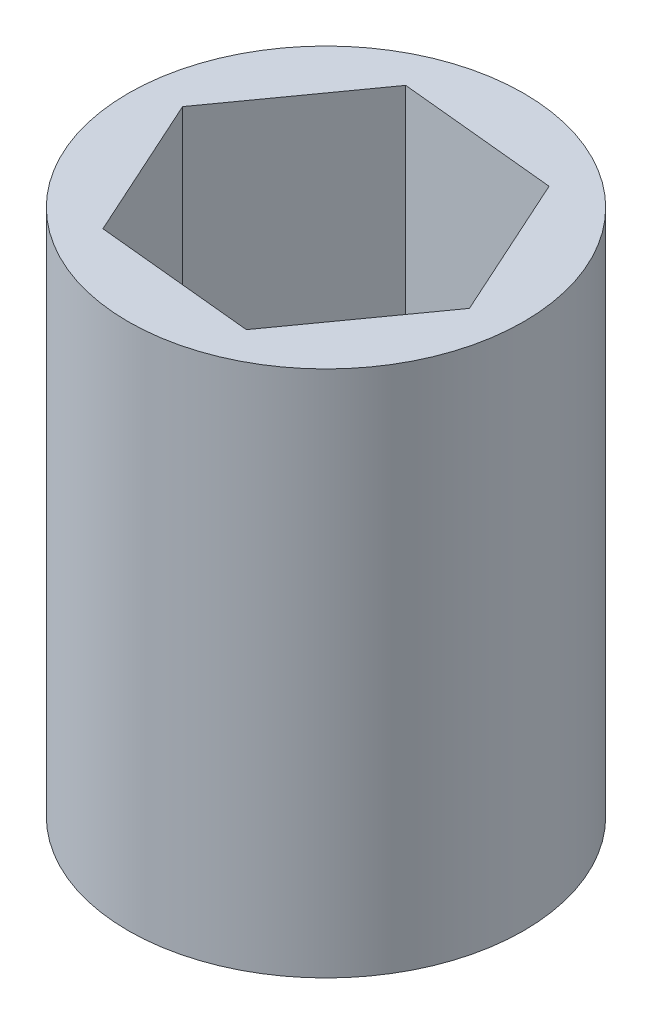
ISO-10303-21;
HEADER;
FILE_DESCRIPTION(('STEP AP214'),'2;1');
FILE_NAME('part.step','',(''),(''),'','','');
FILE_SCHEMA(('AUTOMOTIVE_DESIGN { 1 0 10303 214 1 1 1 1 }'));
ENDSEC;
DATA;
#1=APPLICATION_CONTEXT('core data for automotive mechanical design processes');
#2=APPLICATION_PROTOCOL_DEFINITION('international standard','automotive_design',2000,#1);
#3=PRODUCT_CONTEXT('',#1,'mechanical');
#4=PRODUCT('Part','Part','',(#3));
#5=PRODUCT_RELATED_PRODUCT_CATEGORY('part','',(#4));
#6=PRODUCT_DEFINITION_FORMATION('','',#4);
#7=PRODUCT_DEFINITION_CONTEXT('part definition',#1,'design');
#8=PRODUCT_DEFINITION('design','',#6,#7);
#9=PRODUCT_DEFINITION_SHAPE('','',#8);
#10=(LENGTH_UNIT() NAMED_UNIT(*) SI_UNIT(.MILLI.,.METRE.));
#11=(NAMED_UNIT(*) PLANE_ANGLE_UNIT() SI_UNIT($,.RADIAN.));
#12=(NAMED_UNIT(*) SI_UNIT($,.STERADIAN.) SOLID_ANGLE_UNIT());
#13=UNCERTAINTY_MEASURE_WITH_UNIT(LENGTH_MEASURE(1.E-05),#10,'distance_accuracy_value','');
#14=(GEOMETRIC_REPRESENTATION_CONTEXT(3) GLOBAL_UNCERTAINTY_ASSIGNED_CONTEXT((#13)) GLOBAL_UNIT_ASSIGNED_CONTEXT((#10,
#11,#12)) REPRESENTATION_CONTEXT('',''));
#15=CARTESIAN_POINT('',(0.,0.,0.));
#16=DIRECTION('',(0.,0.,1.));
#17=DIRECTION('',(1.,0.,0.));
#18=AXIS2_PLACEMENT_3D('',#15,#16,#17);
#19=CARTESIAN_POINT('',(0.,50.8,0.));
#20=DIRECTION('',(0.,-1.,0.));
#21=DIRECTION('',(0.,0.,-1.));
#22=AXIS2_PLACEMENT_3D('',#19,#20,#21);
#23=CYLINDRICAL_SURFACE('',#22,19.05);
#24=CARTESIAN_POINT('',(0.,50.8,0.));
#25=DIRECTION('',(0.,1.,0.));
#26=DIRECTION('',(0.,0.,1.));
#27=AXIS2_PLACEMENT_3D('',#24,#25,#26);
#28=CIRCLE('',#27,19.05);
#29=CARTESIAN_POINT('',(0.,50.8,19.05));
#30=VERTEX_POINT('',#29);
#31=EDGE_CURVE('E11',#30,#30,#28,.T.);
#32=ORIENTED_EDGE('',*,*,#31,.F.);
#33=EDGE_LOOP('',(#32));
#34=FACE_BOUND('',#33,.T.);
#35=CARTESIAN_POINT('',(0.,0.,0.));
#36=DIRECTION('',(0.,1.,0.));
#37=DIRECTION('',(0.,0.,1.));
#38=AXIS2_PLACEMENT_3D('',#35,#36,#37);
#39=CIRCLE('',#38,19.05);
#40=CARTESIAN_POINT('',(0.,0.,19.05));
#41=VERTEX_POINT('',#40);
#42=EDGE_CURVE('E42',#41,#41,#39,.T.);
#43=ORIENTED_EDGE('',*,*,#42,.T.);
#44=EDGE_LOOP('',(#43));
#45=FACE_BOUND('',#44,.T.);
#46=ADVANCED_FACE('F39',(#34,#45),#23,.T.);
#47=CARTESIAN_POINT('',(0.,50.8,0.));
#48=DIRECTION('',(0.,1.,0.));
#49=DIRECTION('',(0.,0.,1.));
#50=AXIS2_PLACEMENT_3D('',#47,#48,#49);
#51=PLANE('',#50);
#52=DIRECTION('',(0.582558314438273,0.,-0.812788908806486));
#53=VECTOR('',#52,1.);
#54=CARTESIAN_POINT('',(-15.3236366613952,50.8,-1.510781079292));
#55=LINE('',#54,#53);
#56=CARTESIAN_POINT('',(-15.3236366613952,50.8,-1.510781079292));
#57=VERTEX_POINT('',#56);
#58=CARTESIAN_POINT('',(-6.35344353647385,50.8,-14.0260491667768));
#59=VERTEX_POINT('',#58);
#60=EDGE_CURVE('E107',#57,#59,#55,.T.);
#61=ORIENTED_EDGE('',*,*,#60,.T.);
#62=DIRECTION('',(0.995175000159787,0.,0.0981158450861447));
#63=VECTOR('',#62,1.);
#64=CARTESIAN_POINT('',(-6.35344353647385,50.8,-14.0260491667768));
#65=LINE('',#64,#63);
#66=CARTESIAN_POINT('',(8.97019312492135,50.8,-12.5152680874848));
#67=VERTEX_POINT('',#66);
#68=EDGE_CURVE('E93',#59,#67,#65,.T.);
#69=ORIENTED_EDGE('',*,*,#68,.T.);
#70=DIRECTION('',(0.412616685721513,0.,0.910904753892631));
#71=VECTOR('',#70,1.);
#72=CARTESIAN_POINT('',(8.97019312492135,50.8,-12.5152680874848));
#73=LINE('',#72,#71);
#74=CARTESIAN_POINT('',(15.3236366613952,50.8,1.510781079292));
#75=VERTEX_POINT('',#74);
#76=EDGE_CURVE('E139',#67,#75,#73,.T.);
#77=ORIENTED_EDGE('',*,*,#76,.T.);
#78=DIRECTION('',(-0.582558314438273,0.,0.812788908806486));
#79=VECTOR('',#78,1.);
#80=CARTESIAN_POINT('',(15.3236366613952,50.8,1.510781079292));
#81=LINE('',#80,#79);
#82=CARTESIAN_POINT('',(6.35344353647386,50.8,14.0260491667768));
#83=VERTEX_POINT('',#82);
#84=EDGE_CURVE('E134',#75,#83,#81,.T.);
#85=ORIENTED_EDGE('',*,*,#84,.T.);
#86=DIRECTION('',(-0.995175000159787,0.,-0.0981158450861446));
#87=VECTOR('',#86,1.);
#88=CARTESIAN_POINT('',(6.35344353647386,50.8,14.0260491667768));
#89=LINE('',#88,#87);
#90=CARTESIAN_POINT('',(-8.97019312492135,50.8,12.5152680874848));
#91=VERTEX_POINT('',#90);
#92=EDGE_CURVE('E130',#83,#91,#89,.T.);
#93=ORIENTED_EDGE('',*,*,#92,.T.);
#94=DIRECTION('',(-0.412616685721514,0.,-0.91090475389263));
#95=VECTOR('',#94,1.);
#96=CARTESIAN_POINT('',(-8.97019312492135,50.8,12.5152680874848));
#97=LINE('',#96,#95);
#98=EDGE_CURVE('E117',#91,#57,#97,.T.);
#99=ORIENTED_EDGE('',*,*,#98,.T.);
#100=EDGE_LOOP('',(#61,#69,#77,#85,#93,#99));
#101=FACE_BOUND('',#100,.T.);
#102=ORIENTED_EDGE('',*,*,#31,.T.);
#103=EDGE_LOOP('',(#102));
#104=FACE_BOUND('',#103,.T.);
#105=ADVANCED_FACE('F114',(#101,#104),#51,.T.);
#106=CARTESIAN_POINT('',(0.,0.,0.));
#107=DIRECTION('',(0.,1.,0.));
#108=DIRECTION('',(0.,0.,1.));
#109=AXIS2_PLACEMENT_3D('',#106,#107,#108);
#110=PLANE('',#109);
#111=DIRECTION('',(0.995175000159787,0.,0.0981158450861447));
#112=VECTOR('',#111,1.);
#113=CARTESIAN_POINT('',(-6.35344353647385,0.,-14.0260491667768));
#114=LINE('',#113,#112);
#115=CARTESIAN_POINT('',(-6.35344353647385,0.,-14.0260491667768));
#116=VERTEX_POINT('',#115);
#117=CARTESIAN_POINT('',(8.97019312492135,0.,-12.5152680874848));
#118=VERTEX_POINT('',#117);
#119=EDGE_CURVE('E238',#116,#118,#114,.T.);
#120=ORIENTED_EDGE('',*,*,#119,.F.);
#121=DIRECTION('',(0.582558314438273,0.,-0.812788908806486));
#122=VECTOR('',#121,1.);
#123=CARTESIAN_POINT('',(-15.3236366613952,0.,-1.510781079292));
#124=LINE('',#123,#122);
#125=CARTESIAN_POINT('',(-15.3236366613952,0.,-1.510781079292));
#126=VERTEX_POINT('',#125);
#127=EDGE_CURVE('E110',#126,#116,#124,.T.);
#128=ORIENTED_EDGE('',*,*,#127,.F.);
#129=DIRECTION('',(-0.412616685721513,0.,-0.91090475389263));
#130=VECTOR('',#129,1.);
#131=CARTESIAN_POINT('',(-8.97019312492135,0.,12.5152680874848));
#132=LINE('',#131,#130);
#133=CARTESIAN_POINT('',(-8.97019312492135,0.,12.5152680874848));
#134=VERTEX_POINT('',#133);
#135=EDGE_CURVE('E125',#134,#126,#132,.T.);
#136=ORIENTED_EDGE('',*,*,#135,.F.);
#137=DIRECTION('',(-0.995175000159787,0.,-0.0981158450861446));
#138=VECTOR('',#137,1.);
#139=CARTESIAN_POINT('',(6.35344353647386,0.,14.0260491667768));
#140=LINE('',#139,#138);
#141=CARTESIAN_POINT('',(6.35344353647386,0.,14.0260491667768));
#142=VERTEX_POINT('',#141);
#143=EDGE_CURVE('E62',#142,#134,#140,.T.);
#144=ORIENTED_EDGE('',*,*,#143,.F.);
#145=DIRECTION('',(-0.582558314438273,0.,0.812788908806486));
#146=VECTOR('',#145,1.);
#147=CARTESIAN_POINT('',(15.3236366613952,0.,1.510781079292));
#148=LINE('',#147,#146);
#149=CARTESIAN_POINT('',(15.3236366613952,0.,1.510781079292));
#150=VERTEX_POINT('',#149);
#151=EDGE_CURVE('E121',#150,#142,#148,.T.);
#152=ORIENTED_EDGE('',*,*,#151,.F.);
#153=DIRECTION('',(0.412616685721513,0.,0.91090475389263));
#154=VECTOR('',#153,1.);
#155=CARTESIAN_POINT('',(8.97019312492135,0.,-12.5152680874848));
#156=LINE('',#155,#154);
#157=EDGE_CURVE('E240',#118,#150,#156,.T.);
#158=ORIENTED_EDGE('',*,*,#157,.F.);
#159=EDGE_LOOP('',(#120,#128,#136,#144,#152,#158));
#160=FACE_BOUND('',#159,.T.);
#161=ORIENTED_EDGE('',*,*,#42,.F.);
#162=EDGE_LOOP('',(#161));
#163=FACE_BOUND('',#162,.T.);
#164=ADVANCED_FACE('F156',(#160,#163),#110,.F.);
#165=CARTESIAN_POINT('',(-15.3236366613952,92.3472692608935,-1.510781079292));
#166=DIRECTION('',(-0.812788908806486,0.,-0.582558314438273));
#167=DIRECTION('',(-0.582558314438273,0.,0.812788908806486));
#168=AXIS2_PLACEMENT_3D('',#165,#166,#167);
#169=PLANE('',#168);
#170=DIRECTION('',(0.,-1.,0.));
#171=VECTOR('',#170,1.);
#172=CARTESIAN_POINT('',(-15.3236366613952,92.3472692608935,-1.510781079292));
#173=LINE('',#172,#171);
#174=EDGE_CURVE('E54',#57,#126,#173,.T.);
#175=ORIENTED_EDGE('',*,*,#174,.T.);
#176=ORIENTED_EDGE('',*,*,#127,.T.);
#177=DIRECTION('',(0.,-1.,0.));
#178=VECTOR('',#177,1.);
#179=CARTESIAN_POINT('',(-6.35344353647385,92.3472692608935,-14.0260491667768));
#180=LINE('',#179,#178);
#181=EDGE_CURVE('E97',#59,#116,#180,.T.);
#182=ORIENTED_EDGE('',*,*,#181,.F.);
#183=ORIENTED_EDGE('',*,*,#60,.F.);
#184=EDGE_LOOP('',(#175,#176,#182,#183));
#185=FACE_BOUND('',#184,.T.);
#186=ADVANCED_FACE('F106',(#185),#169,.F.);
#187=CARTESIAN_POINT('',(-6.35344353647385,92.3472692608935,-14.0260491667768));
#188=DIRECTION('',(0.0981158450861447,0.,-0.995175000159787));
#189=DIRECTION('',(-0.995175000159787,0.,-0.0981158450861447));
#190=AXIS2_PLACEMENT_3D('',#187,#188,#189);
#191=PLANE('',#190);
#192=ORIENTED_EDGE('',*,*,#181,.T.);
#193=ORIENTED_EDGE('',*,*,#119,.T.);
#194=DIRECTION('',(0.,-1.,0.));
#195=VECTOR('',#194,1.);
#196=CARTESIAN_POINT('',(8.97019312492135,92.3472692608935,-12.5152680874848));
#197=LINE('',#196,#195);
#198=EDGE_CURVE('E99',#67,#118,#197,.T.);
#199=ORIENTED_EDGE('',*,*,#198,.F.);
#200=ORIENTED_EDGE('',*,*,#68,.F.);
#201=EDGE_LOOP('',(#192,#193,#199,#200));
#202=FACE_BOUND('',#201,.T.);
#203=ADVANCED_FACE('F95',(#202),#191,.F.);
#204=CARTESIAN_POINT('',(8.97019312492135,92.3472692608935,-12.5152680874848));
#205=DIRECTION('',(0.91090475389263,0.,-0.412616685721513));
#206=DIRECTION('',(-0.412616685721513,0.,-0.910904753892631));
#207=AXIS2_PLACEMENT_3D('',#204,#205,#206);
#208=PLANE('',#207);
#209=ORIENTED_EDGE('',*,*,#198,.T.);
#210=ORIENTED_EDGE('',*,*,#157,.T.);
#211=DIRECTION('',(0.,-1.,0.));
#212=VECTOR('',#211,1.);
#213=CARTESIAN_POINT('',(15.3236366613952,92.3472692608935,1.510781079292));
#214=LINE('',#213,#212);
#215=EDGE_CURVE('E138',#75,#150,#214,.T.);
#216=ORIENTED_EDGE('',*,*,#215,.F.);
#217=ORIENTED_EDGE('',*,*,#76,.F.);
#218=EDGE_LOOP('',(#209,#210,#216,#217));
#219=FACE_BOUND('',#218,.T.);
#220=ADVANCED_FACE('F193',(#219),#208,.F.);
#221=CARTESIAN_POINT('',(15.3236366613952,92.3472692608935,1.510781079292));
#222=DIRECTION('',(0.812788908806486,0.,0.582558314438273));
#223=DIRECTION('',(0.582558314438273,0.,-0.812788908806486));
#224=AXIS2_PLACEMENT_3D('',#221,#222,#223);
#225=PLANE('',#224);
#226=ORIENTED_EDGE('',*,*,#215,.T.);
#227=ORIENTED_EDGE('',*,*,#151,.T.);
#228=DIRECTION('',(0.,-1.,0.));
#229=VECTOR('',#228,1.);
#230=CARTESIAN_POINT('',(6.35344353647386,92.3472692608935,14.0260491667768));
#231=LINE('',#230,#229);
#232=EDGE_CURVE('E133',#83,#142,#231,.T.);
#233=ORIENTED_EDGE('',*,*,#232,.F.);
#234=ORIENTED_EDGE('',*,*,#84,.F.);
#235=EDGE_LOOP('',(#226,#227,#233,#234));
#236=FACE_BOUND('',#235,.T.);
#237=ADVANCED_FACE('F202',(#236),#225,.F.);
#238=CARTESIAN_POINT('',(6.35344353647386,92.3472692608935,14.0260491667768));
#239=DIRECTION('',(-0.0981158450861446,0.,0.995175000159787));
#240=DIRECTION('',(0.995175000159787,0.,0.0981158450861446));
#241=AXIS2_PLACEMENT_3D('',#238,#239,#240);
#242=PLANE('',#241);
#243=ORIENTED_EDGE('',*,*,#232,.T.);
#244=ORIENTED_EDGE('',*,*,#143,.T.);
#245=DIRECTION('',(0.,-1.,0.));
#246=VECTOR('',#245,1.);
#247=CARTESIAN_POINT('',(-8.97019312492135,92.3472692608935,12.5152680874848));
#248=LINE('',#247,#246);
#249=EDGE_CURVE('E129',#91,#134,#248,.T.);
#250=ORIENTED_EDGE('',*,*,#249,.F.);
#251=ORIENTED_EDGE('',*,*,#92,.F.);
#252=EDGE_LOOP('',(#243,#244,#250,#251));
#253=FACE_BOUND('',#252,.T.);
#254=ADVANCED_FACE('F212',(#253),#242,.F.);
#255=CARTESIAN_POINT('',(-8.97019312492135,92.3472692608935,12.5152680874848));
#256=DIRECTION('',(-0.91090475389263,0.,0.412616685721514));
#257=DIRECTION('',(0.412616685721514,0.,0.91090475389263));
#258=AXIS2_PLACEMENT_3D('',#255,#256,#257);
#259=PLANE('',#258);
#260=ORIENTED_EDGE('',*,*,#249,.T.);
#261=ORIENTED_EDGE('',*,*,#135,.T.);
#262=ORIENTED_EDGE('',*,*,#174,.F.);
#263=ORIENTED_EDGE('',*,*,#98,.F.);
#264=EDGE_LOOP('',(#260,#261,#262,#263));
#265=FACE_BOUND('',#264,.T.);
#266=ADVANCED_FACE('F222',(#265),#259,.F.);
#267=CLOSED_SHELL('',(#46,#105,#164,#186,#203,#220,#237,#254,#266));
#268=MANIFOLD_SOLID_BREP('B2',#267);
#269=ADVANCED_BREP_SHAPE_REPRESENTATION('',(#18,#268),#14);
#270=SHAPE_DEFINITION_REPRESENTATION(#9,#269);
ENDSEC;
END-ISO-10303-21;
